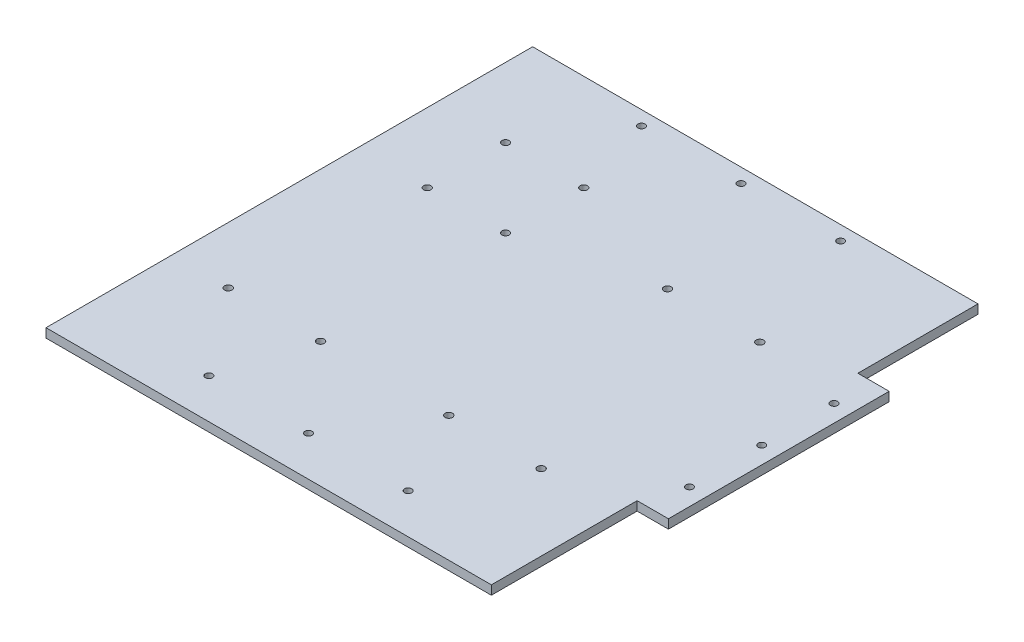
ISO-10303-21;
HEADER;
FILE_DESCRIPTION(('STEP AP214'),'2;1');
FILE_NAME('part.step','',(''),(''),'','','');
FILE_SCHEMA(('AUTOMOTIVE_DESIGN { 1 0 10303 214 1 1 1 1 }'));
ENDSEC;
DATA;
#1=APPLICATION_CONTEXT('core data for automotive mechanical design processes');
#2=APPLICATION_PROTOCOL_DEFINITION('international standard','automotive_design',2000,#1);
#3=PRODUCT_CONTEXT('',#1,'mechanical');
#4=PRODUCT('Part','Part','',(#3));
#5=PRODUCT_RELATED_PRODUCT_CATEGORY('part','',(#4));
#6=PRODUCT_DEFINITION_FORMATION('','',#4);
#7=PRODUCT_DEFINITION_CONTEXT('part definition',#1,'design');
#8=PRODUCT_DEFINITION('design','',#6,#7);
#9=PRODUCT_DEFINITION_SHAPE('','',#8);
#10=(LENGTH_UNIT() NAMED_UNIT(*) SI_UNIT(.MILLI.,.METRE.));
#11=(NAMED_UNIT(*) PLANE_ANGLE_UNIT() SI_UNIT($,.RADIAN.));
#12=(NAMED_UNIT(*) SI_UNIT($,.STERADIAN.) SOLID_ANGLE_UNIT());
#13=UNCERTAINTY_MEASURE_WITH_UNIT(LENGTH_MEASURE(1.E-05),#10,'distance_accuracy_value','');
#14=(GEOMETRIC_REPRESENTATION_CONTEXT(3) GLOBAL_UNCERTAINTY_ASSIGNED_CONTEXT((#13)) GLOBAL_UNIT_ASSIGNED_CONTEXT((#10,
#11,#12)) REPRESENTATION_CONTEXT('',''));
#15=CARTESIAN_POINT('',(0.,0.,0.));
#16=DIRECTION('',(0.,0.,1.));
#17=DIRECTION('',(1.,0.,0.));
#18=AXIS2_PLACEMENT_3D('',#15,#16,#17);
#19=CARTESIAN_POINT('',(156.499999999998,-6.35,171.));
#20=DIRECTION('',(1.,0.,0.));
#21=DIRECTION('',(0.,0.,-1.));
#22=AXIS2_PLACEMENT_3D('',#19,#20,#21);
#23=PLANE('',#22);
#24=DIRECTION('',(0.,0.,-1.));
#25=VECTOR('',#24,1.);
#26=CARTESIAN_POINT('',(156.499999999998,-6.35,171.));
#27=LINE('',#26,#25);
#28=CARTESIAN_POINT('',(156.499999999998,-6.35,171.));
#29=VERTEX_POINT('',#28);
#30=CARTESIAN_POINT('',(156.499999999998,-6.35,68.570201764885));
#31=VERTEX_POINT('',#30);
#32=EDGE_CURVE('E148',#29,#31,#27,.T.);
#33=ORIENTED_EDGE('',*,*,#32,.T.);
#34=DIRECTION('',(0.,1.,0.));
#35=VECTOR('',#34,1.);
#36=CARTESIAN_POINT('',(156.499999999998,-6.35,68.570201764885));
#37=LINE('',#36,#35);
#38=CARTESIAN_POINT('',(156.499999999998,0.,68.570201764885));
#39=VERTEX_POINT('',#38);
#40=EDGE_CURVE('E130',#31,#39,#37,.T.);
#41=ORIENTED_EDGE('',*,*,#40,.T.);
#42=DIRECTION('',(0.,0.,-1.));
#43=VECTOR('',#42,1.);
#44=CARTESIAN_POINT('',(156.499999999998,0.,171.));
#45=LINE('',#44,#43);
#46=CARTESIAN_POINT('',(156.499999999998,0.,171.));
#47=VERTEX_POINT('',#46);
#48=EDGE_CURVE('E158',#47,#39,#45,.T.);
#49=ORIENTED_EDGE('',*,*,#48,.F.);
#50=DIRECTION('',(0.,1.,0.));
#51=VECTOR('',#50,1.);
#52=CARTESIAN_POINT('',(156.499999999998,-6.35,171.));
#53=LINE('',#52,#51);
#54=EDGE_CURVE('E11',#29,#47,#53,.T.);
#55=ORIENTED_EDGE('',*,*,#54,.F.);
#56=EDGE_LOOP('',(#33,#41,#49,#55));
#57=FACE_BOUND('',#56,.T.);
#58=ADVANCED_FACE('F37',(#57),#23,.T.);
#59=DIRECTION('',(0.,1.,0.));
#60=VECTOR('',#59,1.);
#61=CARTESIAN_POINT('',(156.499999999998,-6.35,-86.570201764878));
#62=LINE('',#61,#60);
#63=CARTESIAN_POINT('',(156.499999999998,-6.35,-86.570201764878));
#64=VERTEX_POINT('',#63);
#65=CARTESIAN_POINT('',(156.499999999998,0.,-86.570201764878));
#66=VERTEX_POINT('',#65);
#67=EDGE_CURVE('E145',#64,#66,#62,.T.);
#68=ORIENTED_EDGE('',*,*,#67,.F.);
#69=CARTESIAN_POINT('',(156.499999999998,-6.35,-171.));
#70=VERTEX_POINT('',#69);
#71=EDGE_CURVE('E88',#64,#70,#27,.T.);
#72=ORIENTED_EDGE('',*,*,#71,.T.);
#73=DIRECTION('',(0.,1.,0.));
#74=VECTOR('',#73,1.);
#75=CARTESIAN_POINT('',(156.499999999998,-6.35,-171.));
#76=LINE('',#75,#74);
#77=CARTESIAN_POINT('',(156.499999999998,0.,-171.));
#78=VERTEX_POINT('',#77);
#79=EDGE_CURVE('E41',#70,#78,#76,.T.);
#80=ORIENTED_EDGE('',*,*,#79,.T.);
#81=EDGE_CURVE('E144',#66,#78,#45,.T.);
#82=ORIENTED_EDGE('',*,*,#81,.F.);
#83=EDGE_LOOP('',(#68,#72,#80,#82));
#84=FACE_BOUND('',#83,.T.);
#85=ADVANCED_FACE('F39',(#84),#23,.T.);
#86=CARTESIAN_POINT('',(-156.500000000002,-6.35,171.));
#87=DIRECTION('',(0.,0.,1.));
#88=DIRECTION('',(1.,0.,0.));
#89=AXIS2_PLACEMENT_3D('',#86,#87,#88);
#90=PLANE('',#89);
#91=DIRECTION('',(1.,0.,0.));
#92=VECTOR('',#91,1.);
#93=CARTESIAN_POINT('',(-156.500000000002,0.,171.));
#94=LINE('',#93,#92);
#95=CARTESIAN_POINT('',(-156.500000000002,0.,171.));
#96=VERTEX_POINT('',#95);
#97=EDGE_CURVE('E167',#96,#47,#94,.T.);
#98=ORIENTED_EDGE('',*,*,#97,.F.);
#99=DIRECTION('',(0.,1.,0.));
#100=VECTOR('',#99,1.);
#101=CARTESIAN_POINT('',(-156.500000000002,-6.35,171.));
#102=LINE('',#101,#100);
#103=CARTESIAN_POINT('',(-156.500000000002,-6.35,171.));
#104=VERTEX_POINT('',#103);
#105=EDGE_CURVE('E46',#104,#96,#102,.T.);
#106=ORIENTED_EDGE('',*,*,#105,.F.);
#107=DIRECTION('',(1.,0.,0.));
#108=VECTOR('',#107,1.);
#109=CARTESIAN_POINT('',(-156.500000000002,-6.35,171.));
#110=LINE('',#109,#108);
#111=EDGE_CURVE('E156',#104,#29,#110,.T.);
#112=ORIENTED_EDGE('',*,*,#111,.T.);
#113=ORIENTED_EDGE('',*,*,#54,.T.);
#114=EDGE_LOOP('',(#98,#106,#112,#113));
#115=FACE_BOUND('',#114,.T.);
#116=ADVANCED_FACE('F187',(#115),#90,.T.);
#117=CARTESIAN_POINT('',(-156.500000000002,-6.35,171.));
#118=DIRECTION('',(-1.,0.,0.));
#119=DIRECTION('',(0.,0.,1.));
#120=AXIS2_PLACEMENT_3D('',#117,#118,#119);
#121=PLANE('',#120);
#122=DIRECTION('',(0.,0.,1.));
#123=VECTOR('',#122,1.);
#124=CARTESIAN_POINT('',(-156.500000000002,0.,171.));
#125=LINE('',#124,#123);
#126=CARTESIAN_POINT('',(-156.500000000002,0.,-171.));
#127=VERTEX_POINT('',#126);
#128=EDGE_CURVE('E164',#127,#96,#125,.T.);
#129=ORIENTED_EDGE('',*,*,#128,.F.);
#130=DIRECTION('',(0.,1.,0.));
#131=VECTOR('',#130,1.);
#132=CARTESIAN_POINT('',(-156.500000000002,-6.35,-171.));
#133=LINE('',#132,#131);
#134=CARTESIAN_POINT('',(-156.500000000002,-6.35,-171.));
#135=VERTEX_POINT('',#134);
#136=EDGE_CURVE('E170',#135,#127,#133,.T.);
#137=ORIENTED_EDGE('',*,*,#136,.F.);
#138=DIRECTION('',(0.,0.,1.));
#139=VECTOR('',#138,1.);
#140=CARTESIAN_POINT('',(-156.500000000002,-6.35,171.));
#141=LINE('',#140,#139);
#142=EDGE_CURVE('E153',#135,#104,#141,.T.);
#143=ORIENTED_EDGE('',*,*,#142,.T.);
#144=ORIENTED_EDGE('',*,*,#105,.T.);
#145=EDGE_LOOP('',(#129,#137,#143,#144));
#146=FACE_BOUND('',#145,.T.);
#147=ADVANCED_FACE('F186',(#146),#121,.T.);
#148=CARTESIAN_POINT('',(-156.500000000002,-6.35,-171.));
#149=DIRECTION('',(0.,0.,-1.));
#150=DIRECTION('',(-1.,0.,0.));
#151=AXIS2_PLACEMENT_3D('',#148,#149,#150);
#152=PLANE('',#151);
#153=DIRECTION('',(-1.,0.,0.));
#154=VECTOR('',#153,1.);
#155=CARTESIAN_POINT('',(-156.500000000002,0.,-171.));
#156=LINE('',#155,#154);
#157=EDGE_CURVE('E161',#78,#127,#156,.T.);
#158=ORIENTED_EDGE('',*,*,#157,.F.);
#159=ORIENTED_EDGE('',*,*,#79,.F.);
#160=DIRECTION('',(-1.,0.,0.));
#161=VECTOR('',#160,1.);
#162=CARTESIAN_POINT('',(-156.500000000002,-6.35,-171.));
#163=LINE('',#162,#161);
#164=EDGE_CURVE('E150',#70,#135,#163,.T.);
#165=ORIENTED_EDGE('',*,*,#164,.T.);
#166=ORIENTED_EDGE('',*,*,#136,.T.);
#167=EDGE_LOOP('',(#158,#159,#165,#166));
#168=FACE_BOUND('',#167,.T.);
#169=ADVANCED_FACE('F176',(#168),#152,.T.);
#170=CARTESIAN_POINT('',(0.,-6.35,0.));
#171=DIRECTION('',(0.,-1.,0.));
#172=DIRECTION('',(0.,0.,-1.));
#173=AXIS2_PLACEMENT_3D('',#170,#171,#172);
#174=PLANE('',#173);
#175=CARTESIAN_POINT('',(38.2563465370358,-6.35,-71.0103183641671));
#176=DIRECTION('',(0.,1.,0.));
#177=DIRECTION('',(0.,0.,1.));
#178=AXIS2_PLACEMENT_3D('',#175,#176,#177);
#179=CIRCLE('',#178,2.60000000000004);
#180=CARTESIAN_POINT('',(38.2563465370358,-6.35,-68.4103183641671));
#181=VERTEX_POINT('',#180);
#182=EDGE_CURVE('E326',#181,#181,#179,.T.);
#183=ORIENTED_EDGE('',*,*,#182,.T.);
#184=EDGE_LOOP('',(#183));
#185=FACE_BOUND('',#184,.T.);
#186=CARTESIAN_POINT('',(-52.6874634884457,-6.35,-48.1309669484703));
#187=DIRECTION('',(0.,1.,0.));
#188=DIRECTION('',(0.,0.,1.));
#189=AXIS2_PLACEMENT_3D('',#186,#187,#188);
#190=CIRCLE('',#189,2.55000000000005);
#191=CARTESIAN_POINT('',(-52.6874634884457,-6.35,-45.5809669484703));
#192=VERTEX_POINT('',#191);
#193=EDGE_CURVE('E316',#192,#192,#190,.T.);
#194=ORIENTED_EDGE('',*,*,#193,.T.);
#195=EDGE_LOOP('',(#194));
#196=FACE_BOUND('',#195,.T.);
#197=CARTESIAN_POINT('',(-107.687463488446,-6.35,-48.1309669484707));
#198=DIRECTION('',(0.,1.,0.));
#199=DIRECTION('',(0.,0.,1.));
#200=AXIS2_PLACEMENT_3D('',#197,#198,#199);
#201=CIRCLE('',#200,2.55000000000005);
#202=CARTESIAN_POINT('',(-107.687463488446,-6.35,-45.5809669484707));
#203=VERTEX_POINT('',#202);
#204=EDGE_CURVE('E317',#203,#203,#201,.T.);
#205=ORIENTED_EDGE('',*,*,#204,.T.);
#206=EDGE_LOOP('',(#205));
#207=FACE_BOUND('',#206,.T.);
#208=CARTESIAN_POINT('',(-52.6874634884453,-6.35,-103.13096694847));
#209=DIRECTION('',(0.,1.,0.));
#210=DIRECTION('',(0.,0.,1.));
#211=AXIS2_PLACEMENT_3D('',#208,#209,#210);
#212=CIRCLE('',#211,2.55000000000005);
#213=CARTESIAN_POINT('',(-52.6874634884453,-6.35,-100.58096694847));
#214=VERTEX_POINT('',#213);
#215=EDGE_CURVE('E306',#214,#214,#212,.T.);
#216=ORIENTED_EDGE('',*,*,#215,.T.);
#217=EDGE_LOOP('',(#216));
#218=FACE_BOUND('',#217,.T.);
#219=CARTESIAN_POINT('',(38.3497100427501,-6.35,82.7832500906696));
#220=DIRECTION('',(0.,1.,0.));
#221=DIRECTION('',(0.,0.,1.));
#222=AXIS2_PLACEMENT_3D('',#219,#220,#221);
#223=CIRCLE('',#222,2.60000000000004);
#224=CARTESIAN_POINT('',(38.3497100427501,-6.35,85.3832500906697));
#225=VERTEX_POINT('',#224);
#226=EDGE_CURVE('E349',#225,#225,#223,.T.);
#227=ORIENTED_EDGE('',*,*,#226,.T.);
#228=EDGE_LOOP('',(#227));
#229=FACE_BOUND('',#228,.T.);
#230=CARTESIAN_POINT('',(-51.7502899572497,-6.35,82.783250090669));
#231=DIRECTION('',(0.,1.,0.));
#232=DIRECTION('',(0.,0.,1.));
#233=AXIS2_PLACEMENT_3D('',#230,#231,#232);
#234=CIRCLE('',#233,2.60000000000006);
#235=CARTESIAN_POINT('',(-51.7502899572497,-6.35,85.383250090669));
#236=VERTEX_POINT('',#235);
#237=EDGE_CURVE('E336',#236,#236,#234,.T.);
#238=ORIENTED_EDGE('',*,*,#237,.T.);
#239=EDGE_LOOP('',(#238));
#240=FACE_BOUND('',#239,.T.);
#241=CARTESIAN_POINT('',(-116.65028995725,-6.35,82.7832500906685));
#242=DIRECTION('',(0.,1.,0.));
#243=DIRECTION('',(0.,0.,1.));
#244=AXIS2_PLACEMENT_3D('',#241,#242,#243);
#245=CIRCLE('',#244,2.60000000000016);
#246=CARTESIAN_POINT('',(-116.65028995725,-6.35,85.3832500906687));
#247=VERTEX_POINT('',#246);
#248=EDGE_CURVE('E337',#247,#247,#245,.T.);
#249=ORIENTED_EDGE('',*,*,#248,.T.);
#250=EDGE_LOOP('',(#249));
#251=FACE_BOUND('',#250,.T.);
#252=CARTESIAN_POINT('',(103.156346537036,-6.35,-71.0103183641667));
#253=DIRECTION('',(0.,1.,0.));
#254=DIRECTION('',(0.,0.,1.));
#255=AXIS2_PLACEMENT_3D('',#252,#253,#254);
#256=CIRCLE('',#255,2.60000000000006);
#257=CARTESIAN_POINT('',(103.156346537036,-6.35,-68.4103183641666));
#258=VERTEX_POINT('',#257);
#259=EDGE_CURVE('E325',#258,#258,#256,.T.);
#260=ORIENTED_EDGE('',*,*,#259,.T.);
#261=EDGE_LOOP('',(#260));
#262=FACE_BOUND('',#261,.T.);
#263=CARTESIAN_POINT('',(-107.687463488445,-6.35,-103.130966948471));
#264=DIRECTION('',(0.,1.,0.));
#265=DIRECTION('',(0.,0.,1.));
#266=AXIS2_PLACEMENT_3D('',#263,#264,#265);
#267=CIRCLE('',#266,2.55000000000006);
#268=CARTESIAN_POINT('',(-107.687463488445,-6.35,-100.580966948471));
#269=VERTEX_POINT('',#268);
#270=EDGE_CURVE('E301',#269,#269,#267,.T.);
#271=ORIENTED_EDGE('',*,*,#270,.T.);
#272=EDGE_LOOP('',(#271));
#273=FACE_BOUND('',#272,.T.);
#274=CARTESIAN_POINT('',(103.24971004275,-6.35,82.7832500906701));
#275=DIRECTION('',(0.,1.,0.));
#276=DIRECTION('',(0.,0.,1.));
#277=AXIS2_PLACEMENT_3D('',#274,#275,#276);
#278=CIRCLE('',#277,2.60000000000004);
#279=CARTESIAN_POINT('',(103.24971004275,-6.35,85.3832500906701));
#280=VERTEX_POINT('',#279);
#281=EDGE_CURVE('E357',#280,#280,#278,.T.);
#282=ORIENTED_EDGE('',*,*,#281,.T.);
#283=EDGE_LOOP('',(#282));
#284=FACE_BOUND('',#283,.T.);
#285=CARTESIAN_POINT('',(-70.,-6.35,143.000000000004));
#286=DIRECTION('',(0.,1.,0.));
#287=DIRECTION('',(0.,0.,1.));
#288=AXIS2_PLACEMENT_3D('',#285,#286,#287);
#289=CIRCLE('',#288,2.5);
#290=CARTESIAN_POINT('',(-70.,-6.35,145.500000000004));
#291=VERTEX_POINT('',#290);
#292=EDGE_CURVE('E373',#291,#291,#289,.T.);
#293=ORIENTED_EDGE('',*,*,#292,.T.);
#294=EDGE_LOOP('',(#293));
#295=FACE_BOUND('',#294,.T.);
#296=CARTESIAN_POINT('',(70.,-6.35,143.000000000004));
#297=DIRECTION('',(0.,1.,0.));
#298=DIRECTION('',(0.,0.,-1.));
#299=AXIS2_PLACEMENT_3D('',#296,#297,#298);
#300=CIRCLE('',#299,2.5);
#301=CARTESIAN_POINT('',(70.,-6.35,140.500000000004));
#302=VERTEX_POINT('',#301);
#303=EDGE_CURVE('E379',#302,#302,#300,.T.);
#304=ORIENTED_EDGE('',*,*,#303,.T.);
#305=EDGE_LOOP('',(#304));
#306=FACE_BOUND('',#305,.T.);
#307=CARTESIAN_POINT('',(-70.,-6.35,-160.999999999996));
#308=DIRECTION('',(0.,1.,0.));
#309=DIRECTION('',(0.,0.,-1.));
#310=AXIS2_PLACEMENT_3D('',#307,#308,#309);
#311=CIRCLE('',#310,2.50000000000001);
#312=CARTESIAN_POINT('',(-70.,-6.35,-163.499999999996));
#313=VERTEX_POINT('',#312);
#314=EDGE_CURVE('E385',#313,#313,#311,.T.);
#315=ORIENTED_EDGE('',*,*,#314,.T.);
#316=EDGE_LOOP('',(#315));
#317=FACE_BOUND('',#316,.T.);
#318=CARTESIAN_POINT('',(0.,-6.35,-160.999999999996));
#319=DIRECTION('',(0.,1.,0.));
#320=DIRECTION('',(0.,0.,-1.));
#321=AXIS2_PLACEMENT_3D('',#318,#319,#320);
#322=CIRCLE('',#321,2.49999999999999);
#323=CARTESIAN_POINT('',(0.,-6.35,-163.499999999996));
#324=VERTEX_POINT('',#323);
#325=EDGE_CURVE('E366',#324,#324,#322,.T.);
#326=ORIENTED_EDGE('',*,*,#325,.T.);
#327=EDGE_LOOP('',(#326));
#328=FACE_BOUND('',#327,.T.);
#329=CARTESIAN_POINT('',(70.,-6.35,-160.999999999996));
#330=DIRECTION('',(0.,1.,0.));
#331=DIRECTION('',(0.,0.,1.));
#332=AXIS2_PLACEMENT_3D('',#329,#330,#331);
#333=CIRCLE('',#332,2.50000000000001);
#334=CARTESIAN_POINT('',(70.,-6.35,-158.499999999996));
#335=VERTEX_POINT('',#334);
#336=EDGE_CURVE('E360',#335,#335,#333,.T.);
#337=ORIENTED_EDGE('',*,*,#336,.T.);
#338=EDGE_LOOP('',(#337));
#339=FACE_BOUND('',#338,.T.);
#340=CARTESIAN_POINT('',(0.,-6.35,143.000000000004));
#341=DIRECTION('',(0.,1.,0.));
#342=DIRECTION('',(0.,0.,1.));
#343=AXIS2_PLACEMENT_3D('',#340,#341,#342);
#344=CIRCLE('',#343,2.5);
#345=CARTESIAN_POINT('',(0.,-6.35,145.500000000004));
#346=VERTEX_POINT('',#345);
#347=EDGE_CURVE('E393',#346,#346,#344,.T.);
#348=ORIENTED_EDGE('',*,*,#347,.T.);
#349=EDGE_LOOP('',(#348));
#350=FACE_BOUND('',#349,.T.);
#351=ORIENTED_EDGE('',*,*,#32,.F.);
#352=ORIENTED_EDGE('',*,*,#111,.F.);
#353=ORIENTED_EDGE('',*,*,#142,.F.);
#354=ORIENTED_EDGE('',*,*,#164,.F.);
#355=ORIENTED_EDGE('',*,*,#71,.F.);
#356=DIRECTION('',(-1.,0.,0.));
#357=VECTOR('',#356,1.);
#358=CARTESIAN_POINT('',(178.499999999998,-6.35,-86.570201764878));
#359=LINE('',#358,#357);
#360=CARTESIAN_POINT('',(178.499999999998,-6.35,-86.570201764878));
#361=VERTEX_POINT('',#360);
#362=EDGE_CURVE('E120',#361,#64,#359,.T.);
#363=ORIENTED_EDGE('',*,*,#362,.F.);
#364=DIRECTION('',(0.,0.,-1.));
#365=VECTOR('',#364,1.);
#366=CARTESIAN_POINT('',(178.499999999998,-6.35,68.570201764885));
#367=LINE('',#366,#365);
#368=CARTESIAN_POINT('',(178.499999999998,-6.35,68.570201764885));
#369=VERTEX_POINT('',#368);
#370=EDGE_CURVE('E115',#369,#361,#367,.T.);
#371=ORIENTED_EDGE('',*,*,#370,.F.);
#372=DIRECTION('',(1.,0.,0.));
#373=VECTOR('',#372,1.);
#374=CARTESIAN_POINT('',(156.499999999998,-6.35,68.570201764885));
#375=LINE('',#374,#373);
#376=EDGE_CURVE('E127',#31,#369,#375,.T.);
#377=ORIENTED_EDGE('',*,*,#376,.F.);
#378=EDGE_LOOP('',(#351,#352,#353,#354,#355,#363,#371,#377));
#379=FACE_BOUND('',#378,.T.);
#380=CARTESIAN_POINT('',(166.499999999998,-6.35,-59.7999999999965));
#381=DIRECTION('',(0.,1.,0.));
#382=DIRECTION('',(0.,0.,-1.));
#383=AXIS2_PLACEMENT_3D('',#380,#381,#382);
#384=CIRCLE('',#383,2.5);
#385=CARTESIAN_POINT('',(166.499999999998,-6.35,-62.2999999999965));
#386=VERTEX_POINT('',#385);
#387=EDGE_CURVE('E399',#386,#386,#384,.T.);
#388=ORIENTED_EDGE('',*,*,#387,.T.);
#389=EDGE_LOOP('',(#388));
#390=FACE_BOUND('',#389,.T.);
#391=CARTESIAN_POINT('',(166.499999999998,-6.35,41.8000000000035));
#392=DIRECTION('',(0.,1.,0.));
#393=DIRECTION('',(0.,0.,1.));
#394=AXIS2_PLACEMENT_3D('',#391,#392,#393);
#395=CIRCLE('',#394,2.5);
#396=CARTESIAN_POINT('',(166.499999999998,-6.35,44.3000000000035));
#397=VERTEX_POINT('',#396);
#398=EDGE_CURVE('E405',#397,#397,#395,.T.);
#399=ORIENTED_EDGE('',*,*,#398,.T.);
#400=EDGE_LOOP('',(#399));
#401=FACE_BOUND('',#400,.T.);
#402=CARTESIAN_POINT('',(166.499999999998,-6.35,-8.99999999999648));
#403=DIRECTION('',(0.,1.,0.));
#404=DIRECTION('',(0.,0.,1.));
#405=AXIS2_PLACEMENT_3D('',#402,#403,#404);
#406=CIRCLE('',#405,2.5);
#407=CARTESIAN_POINT('',(166.499999999998,-6.35,-6.49999999999649));
#408=VERTEX_POINT('',#407);
#409=EDGE_CURVE('E141',#408,#408,#406,.T.);
#410=ORIENTED_EDGE('',*,*,#409,.T.);
#411=EDGE_LOOP('',(#410));
#412=FACE_BOUND('',#411,.T.);
#413=ADVANCED_FACE('F125',(#185,#196,#207,#218,#229,#240,#251,#262,#273,#284,#295,#306,#317,
#328,#339,#350,#379,#390,#401,#412),#174,.T.);
#414=CARTESIAN_POINT('',(0.,0.,0.));
#415=DIRECTION('',(0.,-1.,0.));
#416=DIRECTION('',(0.,0.,-1.));
#417=AXIS2_PLACEMENT_3D('',#414,#415,#416);
#418=PLANE('',#417);
#419=CARTESIAN_POINT('',(38.2563465370358,0.,-71.0103183641671));
#420=DIRECTION('',(0.,1.,0.));
#421=DIRECTION('',(0.,0.,1.));
#422=AXIS2_PLACEMENT_3D('',#419,#420,#421);
#423=CIRCLE('',#422,2.60000000000004);
#424=CARTESIAN_POINT('',(38.2563465370358,0.,-68.4103183641671));
#425=VERTEX_POINT('',#424);
#426=EDGE_CURVE('E322',#425,#425,#423,.T.);
#427=ORIENTED_EDGE('',*,*,#426,.F.);
#428=EDGE_LOOP('',(#427));
#429=FACE_BOUND('',#428,.T.);
#430=CARTESIAN_POINT('',(-52.6874634884457,0.,-48.1309669484703));
#431=DIRECTION('',(0.,1.,0.));
#432=DIRECTION('',(0.,0.,1.));
#433=AXIS2_PLACEMENT_3D('',#430,#431,#432);
#434=CIRCLE('',#433,2.55000000000005);
#435=CARTESIAN_POINT('',(-52.6874634884457,0.,-45.5809669484703));
#436=VERTEX_POINT('',#435);
#437=EDGE_CURVE('E328',#436,#436,#434,.T.);
#438=ORIENTED_EDGE('',*,*,#437,.F.);
#439=EDGE_LOOP('',(#438));
#440=FACE_BOUND('',#439,.T.);
#441=CARTESIAN_POINT('',(-107.687463488446,0.,-48.1309669484707));
#442=DIRECTION('',(0.,1.,0.));
#443=DIRECTION('',(0.,0.,1.));
#444=AXIS2_PLACEMENT_3D('',#441,#442,#443);
#445=CIRCLE('',#444,2.55000000000005);
#446=CARTESIAN_POINT('',(-107.687463488446,0.,-45.5809669484707));
#447=VERTEX_POINT('',#446);
#448=EDGE_CURVE('E313',#447,#447,#445,.T.);
#449=ORIENTED_EDGE('',*,*,#448,.F.);
#450=EDGE_LOOP('',(#449));
#451=FACE_BOUND('',#450,.T.);
#452=CARTESIAN_POINT('',(-52.6874634884453,0.,-103.13096694847));
#453=DIRECTION('',(0.,1.,0.));
#454=DIRECTION('',(0.,0.,1.));
#455=AXIS2_PLACEMENT_3D('',#452,#453,#454);
#456=CIRCLE('',#455,2.55000000000005);
#457=CARTESIAN_POINT('',(-52.6874634884453,0.,-100.58096694847));
#458=VERTEX_POINT('',#457);
#459=EDGE_CURVE('E309',#458,#458,#456,.T.);
#460=ORIENTED_EDGE('',*,*,#459,.F.);
#461=EDGE_LOOP('',(#460));
#462=FACE_BOUND('',#461,.T.);
#463=CARTESIAN_POINT('',(38.3497100427501,0.,82.7832500906696));
#464=DIRECTION('',(0.,1.,0.));
#465=DIRECTION('',(0.,0.,1.));
#466=AXIS2_PLACEMENT_3D('',#463,#464,#465);
#467=CIRCLE('',#466,2.60000000000004);
#468=CARTESIAN_POINT('',(38.3497100427501,0.,85.3832500906697));
#469=VERTEX_POINT('',#468);
#470=EDGE_CURVE('E345',#469,#469,#467,.T.);
#471=ORIENTED_EDGE('',*,*,#470,.F.);
#472=EDGE_LOOP('',(#471));
#473=FACE_BOUND('',#472,.T.);
#474=CARTESIAN_POINT('',(-51.7502899572497,0.,82.783250090669));
#475=DIRECTION('',(0.,1.,0.));
#476=DIRECTION('',(0.,0.,1.));
#477=AXIS2_PLACEMENT_3D('',#474,#475,#476);
#478=CIRCLE('',#477,2.60000000000006);
#479=CARTESIAN_POINT('',(-51.7502899572497,0.,85.383250090669));
#480=VERTEX_POINT('',#479);
#481=EDGE_CURVE('E352',#480,#480,#478,.T.);
#482=ORIENTED_EDGE('',*,*,#481,.F.);
#483=EDGE_LOOP('',(#482));
#484=FACE_BOUND('',#483,.T.);
#485=CARTESIAN_POINT('',(-116.65028995725,0.,82.7832500906685));
#486=DIRECTION('',(0.,1.,0.));
#487=DIRECTION('',(0.,0.,1.));
#488=AXIS2_PLACEMENT_3D('',#485,#486,#487);
#489=CIRCLE('',#488,2.60000000000016);
#490=CARTESIAN_POINT('',(-116.65028995725,0.,85.3832500906687));
#491=VERTEX_POINT('',#490);
#492=EDGE_CURVE('E333',#491,#491,#489,.T.);
#493=ORIENTED_EDGE('',*,*,#492,.F.);
#494=EDGE_LOOP('',(#493));
#495=FACE_BOUND('',#494,.T.);
#496=CARTESIAN_POINT('',(103.156346537036,0.,-71.0103183641667));
#497=DIRECTION('',(0.,1.,0.));
#498=DIRECTION('',(0.,0.,1.));
#499=AXIS2_PLACEMENT_3D('',#496,#497,#498);
#500=CIRCLE('',#499,2.60000000000006);
#501=CARTESIAN_POINT('',(103.156346537036,0.,-68.4103183641666));
#502=VERTEX_POINT('',#501);
#503=EDGE_CURVE('E340',#502,#502,#500,.T.);
#504=ORIENTED_EDGE('',*,*,#503,.F.);
#505=EDGE_LOOP('',(#504));
#506=FACE_BOUND('',#505,.T.);
#507=CARTESIAN_POINT('',(-107.687463488445,0.,-103.130966948471));
#508=DIRECTION('',(0.,1.,0.));
#509=DIRECTION('',(0.,0.,1.));
#510=AXIS2_PLACEMENT_3D('',#507,#508,#509);
#511=CIRCLE('',#510,2.55000000000006);
#512=CARTESIAN_POINT('',(-107.687463488445,0.,-100.580966948471));
#513=VERTEX_POINT('',#512);
#514=EDGE_CURVE('E304',#513,#513,#511,.T.);
#515=ORIENTED_EDGE('',*,*,#514,.F.);
#516=EDGE_LOOP('',(#515));
#517=FACE_BOUND('',#516,.T.);
#518=CARTESIAN_POINT('',(103.24971004275,0.,82.7832500906701));
#519=DIRECTION('',(0.,1.,0.));
#520=DIRECTION('',(0.,0.,1.));
#521=AXIS2_PLACEMENT_3D('',#518,#519,#520);
#522=CIRCLE('',#521,2.60000000000004);
#523=CARTESIAN_POINT('',(103.24971004275,0.,85.3832500906701));
#524=VERTEX_POINT('',#523);
#525=EDGE_CURVE('E348',#524,#524,#522,.T.);
#526=ORIENTED_EDGE('',*,*,#525,.F.);
#527=EDGE_LOOP('',(#526));
#528=FACE_BOUND('',#527,.T.);
#529=CARTESIAN_POINT('',(-70.,0.,143.000000000004));
#530=DIRECTION('',(0.,1.,0.));
#531=DIRECTION('',(0.,0.,1.));
#532=AXIS2_PLACEMENT_3D('',#529,#530,#531);
#533=CIRCLE('',#532,2.5);
#534=CARTESIAN_POINT('',(-70.,0.,145.500000000004));
#535=VERTEX_POINT('',#534);
#536=EDGE_CURVE('E369',#535,#535,#533,.T.);
#537=ORIENTED_EDGE('',*,*,#536,.F.);
#538=EDGE_LOOP('',(#537));
#539=FACE_BOUND('',#538,.T.);
#540=CARTESIAN_POINT('',(70.,0.,143.000000000004));
#541=DIRECTION('',(0.,1.,0.));
#542=DIRECTION('',(0.,0.,-1.));
#543=AXIS2_PLACEMENT_3D('',#540,#541,#542);
#544=CIRCLE('',#543,2.5);
#545=CARTESIAN_POINT('',(70.,0.,140.500000000004));
#546=VERTEX_POINT('',#545);
#547=EDGE_CURVE('E376',#546,#546,#544,.T.);
#548=ORIENTED_EDGE('',*,*,#547,.F.);
#549=EDGE_LOOP('',(#548));
#550=FACE_BOUND('',#549,.T.);
#551=CARTESIAN_POINT('',(-70.,0.,-160.999999999996));
#552=DIRECTION('',(0.,1.,0.));
#553=DIRECTION('',(0.,0.,-1.));
#554=AXIS2_PLACEMENT_3D('',#551,#552,#553);
#555=CIRCLE('',#554,2.50000000000001);
#556=CARTESIAN_POINT('',(-70.,0.,-163.499999999996));
#557=VERTEX_POINT('',#556);
#558=EDGE_CURVE('E382',#557,#557,#555,.T.);
#559=ORIENTED_EDGE('',*,*,#558,.F.);
#560=EDGE_LOOP('',(#559));
#561=FACE_BOUND('',#560,.T.);
#562=CARTESIAN_POINT('',(0.,0.,-160.999999999996));
#563=DIRECTION('',(0.,1.,0.));
#564=DIRECTION('',(0.,0.,-1.));
#565=AXIS2_PLACEMENT_3D('',#562,#563,#564);
#566=CIRCLE('',#565,2.49999999999999);
#567=CARTESIAN_POINT('',(0.,0.,-163.499999999996));
#568=VERTEX_POINT('',#567);
#569=EDGE_CURVE('E388',#568,#568,#566,.T.);
#570=ORIENTED_EDGE('',*,*,#569,.F.);
#571=EDGE_LOOP('',(#570));
#572=FACE_BOUND('',#571,.T.);
#573=CARTESIAN_POINT('',(70.,0.,-160.999999999996));
#574=DIRECTION('',(0.,1.,0.));
#575=DIRECTION('',(0.,0.,1.));
#576=AXIS2_PLACEMENT_3D('',#573,#574,#575);
#577=CIRCLE('',#576,2.50000000000001);
#578=CARTESIAN_POINT('',(70.,0.,-158.499999999996));
#579=VERTEX_POINT('',#578);
#580=EDGE_CURVE('E363',#579,#579,#577,.T.);
#581=ORIENTED_EDGE('',*,*,#580,.F.);
#582=EDGE_LOOP('',(#581));
#583=FACE_BOUND('',#582,.T.);
#584=CARTESIAN_POINT('',(0.,0.,143.000000000004));
#585=DIRECTION('',(0.,1.,0.));
#586=DIRECTION('',(0.,0.,1.));
#587=AXIS2_PLACEMENT_3D('',#584,#585,#586);
#588=CIRCLE('',#587,2.5);
#589=CARTESIAN_POINT('',(0.,0.,145.500000000004));
#590=VERTEX_POINT('',#589);
#591=EDGE_CURVE('E372',#590,#590,#588,.T.);
#592=ORIENTED_EDGE('',*,*,#591,.F.);
#593=EDGE_LOOP('',(#592));
#594=FACE_BOUND('',#593,.T.);
#595=ORIENTED_EDGE('',*,*,#48,.T.);
#596=DIRECTION('',(1.,0.,0.));
#597=VECTOR('',#596,1.);
#598=CARTESIAN_POINT('',(156.499999999998,0.,68.570201764885));
#599=LINE('',#598,#597);
#600=CARTESIAN_POINT('',(178.499999999998,0.,68.570201764885));
#601=VERTEX_POINT('',#600);
#602=EDGE_CURVE('E54',#39,#601,#599,.T.);
#603=ORIENTED_EDGE('',*,*,#602,.T.);
#604=DIRECTION('',(0.,0.,-1.));
#605=VECTOR('',#604,1.);
#606=CARTESIAN_POINT('',(178.499999999998,0.,68.570201764885));
#607=LINE('',#606,#605);
#608=CARTESIAN_POINT('',(178.499999999998,0.,-86.570201764878));
#609=VERTEX_POINT('',#608);
#610=EDGE_CURVE('E117',#601,#609,#607,.T.);
#611=ORIENTED_EDGE('',*,*,#610,.T.);
#612=DIRECTION('',(-1.,0.,0.));
#613=VECTOR('',#612,1.);
#614=CARTESIAN_POINT('',(178.499999999998,0.,-86.570201764878));
#615=LINE('',#614,#613);
#616=EDGE_CURVE('E131',#609,#66,#615,.T.);
#617=ORIENTED_EDGE('',*,*,#616,.T.);
#618=ORIENTED_EDGE('',*,*,#81,.T.);
#619=ORIENTED_EDGE('',*,*,#157,.T.);
#620=ORIENTED_EDGE('',*,*,#128,.T.);
#621=ORIENTED_EDGE('',*,*,#97,.T.);
#622=EDGE_LOOP('',(#595,#603,#611,#617,#618,#619,#620,#621));
#623=FACE_BOUND('',#622,.T.);
#624=CARTESIAN_POINT('',(166.499999999998,0.,-59.7999999999965));
#625=DIRECTION('',(0.,1.,0.));
#626=DIRECTION('',(0.,0.,-1.));
#627=AXIS2_PLACEMENT_3D('',#624,#625,#626);
#628=CIRCLE('',#627,2.5);
#629=CARTESIAN_POINT('',(166.499999999998,0.,-62.2999999999965));
#630=VERTEX_POINT('',#629);
#631=EDGE_CURVE('E396',#630,#630,#628,.T.);
#632=ORIENTED_EDGE('',*,*,#631,.F.);
#633=EDGE_LOOP('',(#632));
#634=FACE_BOUND('',#633,.T.);
#635=CARTESIAN_POINT('',(166.499999999998,0.,41.8000000000035));
#636=DIRECTION('',(0.,1.,0.));
#637=DIRECTION('',(0.,0.,1.));
#638=AXIS2_PLACEMENT_3D('',#635,#636,#637);
#639=CIRCLE('',#638,2.5);
#640=CARTESIAN_POINT('',(166.499999999998,0.,44.3000000000035));
#641=VERTEX_POINT('',#640);
#642=EDGE_CURVE('E402',#641,#641,#639,.T.);
#643=ORIENTED_EDGE('',*,*,#642,.F.);
#644=EDGE_LOOP('',(#643));
#645=FACE_BOUND('',#644,.T.);
#646=CARTESIAN_POINT('',(166.499999999998,0.,-8.99999999999648));
#647=DIRECTION('',(0.,1.,0.));
#648=DIRECTION('',(0.,0.,1.));
#649=AXIS2_PLACEMENT_3D('',#646,#647,#648);
#650=CIRCLE('',#649,2.5);
#651=CARTESIAN_POINT('',(166.499999999998,0.,-6.49999999999649));
#652=VERTEX_POINT('',#651);
#653=EDGE_CURVE('E136',#652,#652,#650,.T.);
#654=ORIENTED_EDGE('',*,*,#653,.F.);
#655=EDGE_LOOP('',(#654));
#656=FACE_BOUND('',#655,.T.);
#657=ADVANCED_FACE('F178',(#429,#440,#451,#462,#473,#484,#495,#506,#517,#528,#539,#550,#561,
#572,#583,#594,#623,#634,#645,#656),#418,.F.);
#658=CARTESIAN_POINT('',(156.499999999998,-6.35,68.570201764885));
#659=DIRECTION('',(0.,0.,1.));
#660=DIRECTION('',(1.,0.,0.));
#661=AXIS2_PLACEMENT_3D('',#658,#659,#660);
#662=PLANE('',#661);
#663=ORIENTED_EDGE('',*,*,#602,.F.);
#664=ORIENTED_EDGE('',*,*,#40,.F.);
#665=ORIENTED_EDGE('',*,*,#376,.T.);
#666=DIRECTION('',(0.,1.,0.));
#667=VECTOR('',#666,1.);
#668=CARTESIAN_POINT('',(178.499999999998,-6.35,68.570201764885));
#669=LINE('',#668,#667);
#670=EDGE_CURVE('E112',#369,#601,#669,.T.);
#671=ORIENTED_EDGE('',*,*,#670,.T.);
#672=EDGE_LOOP('',(#663,#664,#665,#671));
#673=FACE_BOUND('',#672,.T.);
#674=ADVANCED_FACE('F129',(#673),#662,.T.);
#675=CARTESIAN_POINT('',(178.499999999998,-6.35,-86.570201764878));
#676=DIRECTION('',(0.,0.,-1.));
#677=DIRECTION('',(-1.,0.,0.));
#678=AXIS2_PLACEMENT_3D('',#675,#676,#677);
#679=PLANE('',#678);
#680=ORIENTED_EDGE('',*,*,#616,.F.);
#681=DIRECTION('',(0.,1.,0.));
#682=VECTOR('',#681,1.);
#683=CARTESIAN_POINT('',(178.499999999998,-6.35,-86.570201764878));
#684=LINE('',#683,#682);
#685=EDGE_CURVE('E119',#361,#609,#684,.T.);
#686=ORIENTED_EDGE('',*,*,#685,.F.);
#687=ORIENTED_EDGE('',*,*,#362,.T.);
#688=ORIENTED_EDGE('',*,*,#67,.T.);
#689=EDGE_LOOP('',(#680,#686,#687,#688));
#690=FACE_BOUND('',#689,.T.);
#691=ADVANCED_FACE('F182',(#690),#679,.T.);
#692=CARTESIAN_POINT('',(178.499999999998,-6.35,68.570201764885));
#693=DIRECTION('',(1.,0.,0.));
#694=DIRECTION('',(0.,0.,-1.));
#695=AXIS2_PLACEMENT_3D('',#692,#693,#694);
#696=PLANE('',#695);
#697=ORIENTED_EDGE('',*,*,#610,.F.);
#698=ORIENTED_EDGE('',*,*,#670,.F.);
#699=ORIENTED_EDGE('',*,*,#370,.T.);
#700=ORIENTED_EDGE('',*,*,#685,.T.);
#701=EDGE_LOOP('',(#697,#698,#699,#700));
#702=FACE_BOUND('',#701,.T.);
#703=ADVANCED_FACE('F114',(#702),#696,.T.);
#704=CARTESIAN_POINT('',(166.499999999998,-6.35,-8.99999999999648));
#705=DIRECTION('',(0.,1.,0.));
#706=DIRECTION('',(0.,0.,1.));
#707=AXIS2_PLACEMENT_3D('',#704,#705,#706);
#708=CYLINDRICAL_SURFACE('',#707,2.5);
#709=ORIENTED_EDGE('',*,*,#409,.F.);
#710=EDGE_LOOP('',(#709));
#711=FACE_BOUND('',#710,.T.);
#712=ORIENTED_EDGE('',*,*,#653,.T.);
#713=EDGE_LOOP('',(#712));
#714=FACE_BOUND('',#713,.T.);
#715=ADVANCED_FACE('F219',(#711,#714),#708,.F.);
#716=CARTESIAN_POINT('',(166.499999999998,-6.35,41.8000000000035));
#717=DIRECTION('',(0.,1.,0.));
#718=DIRECTION('',(0.,0.,1.));
#719=AXIS2_PLACEMENT_3D('',#716,#717,#718);
#720=CYLINDRICAL_SURFACE('',#719,2.5);
#721=ORIENTED_EDGE('',*,*,#398,.F.);
#722=EDGE_LOOP('',(#721));
#723=FACE_BOUND('',#722,.T.);
#724=ORIENTED_EDGE('',*,*,#642,.T.);
#725=EDGE_LOOP('',(#724));
#726=FACE_BOUND('',#725,.T.);
#727=ADVANCED_FACE('F224',(#723,#726),#720,.F.);
#728=CARTESIAN_POINT('',(166.499999999998,-6.35,-59.7999999999965));
#729=DIRECTION('',(0.,1.,0.));
#730=DIRECTION('',(0.,0.,1.));
#731=AXIS2_PLACEMENT_3D('',#728,#729,#730);
#732=CYLINDRICAL_SURFACE('',#731,2.5);
#733=ORIENTED_EDGE('',*,*,#387,.F.);
#734=EDGE_LOOP('',(#733));
#735=FACE_BOUND('',#734,.T.);
#736=ORIENTED_EDGE('',*,*,#631,.T.);
#737=EDGE_LOOP('',(#736));
#738=FACE_BOUND('',#737,.T.);
#739=ADVANCED_FACE('F228',(#735,#738),#732,.F.);
#740=CARTESIAN_POINT('',(0.,-6.35,143.000000000004));
#741=DIRECTION('',(0.,1.,0.));
#742=DIRECTION('',(0.,0.,1.));
#743=AXIS2_PLACEMENT_3D('',#740,#741,#742);
#744=CYLINDRICAL_SURFACE('',#743,2.5);
#745=ORIENTED_EDGE('',*,*,#347,.F.);
#746=EDGE_LOOP('',(#745));
#747=FACE_BOUND('',#746,.T.);
#748=ORIENTED_EDGE('',*,*,#591,.T.);
#749=EDGE_LOOP('',(#748));
#750=FACE_BOUND('',#749,.T.);
#751=ADVANCED_FACE('F232',(#747,#750),#744,.F.);
#752=CARTESIAN_POINT('',(70.,-6.35,-160.999999999996));
#753=DIRECTION('',(0.,1.,0.));
#754=DIRECTION('',(0.,0.,1.));
#755=AXIS2_PLACEMENT_3D('',#752,#753,#754);
#756=CYLINDRICAL_SURFACE('',#755,2.50000000000001);
#757=ORIENTED_EDGE('',*,*,#336,.F.);
#758=EDGE_LOOP('',(#757));
#759=FACE_BOUND('',#758,.T.);
#760=ORIENTED_EDGE('',*,*,#580,.T.);
#761=EDGE_LOOP('',(#760));
#762=FACE_BOUND('',#761,.T.);
#763=ADVANCED_FACE('F236',(#759,#762),#756,.F.);
#764=CARTESIAN_POINT('',(0.,-6.35,-160.999999999996));
#765=DIRECTION('',(0.,1.,0.));
#766=DIRECTION('',(0.,0.,1.));
#767=AXIS2_PLACEMENT_3D('',#764,#765,#766);
#768=CYLINDRICAL_SURFACE('',#767,2.49999999999999);
#769=ORIENTED_EDGE('',*,*,#325,.F.);
#770=EDGE_LOOP('',(#769));
#771=FACE_BOUND('',#770,.T.);
#772=ORIENTED_EDGE('',*,*,#569,.T.);
#773=EDGE_LOOP('',(#772));
#774=FACE_BOUND('',#773,.T.);
#775=ADVANCED_FACE('F238',(#771,#774),#768,.F.);
#776=CARTESIAN_POINT('',(-70.,-6.35,-160.999999999996));
#777=DIRECTION('',(0.,1.,0.));
#778=DIRECTION('',(0.,0.,1.));
#779=AXIS2_PLACEMENT_3D('',#776,#777,#778);
#780=CYLINDRICAL_SURFACE('',#779,2.50000000000001);
#781=ORIENTED_EDGE('',*,*,#314,.F.);
#782=EDGE_LOOP('',(#781));
#783=FACE_BOUND('',#782,.T.);
#784=ORIENTED_EDGE('',*,*,#558,.T.);
#785=EDGE_LOOP('',(#784));
#786=FACE_BOUND('',#785,.T.);
#787=ADVANCED_FACE('F241',(#783,#786),#780,.F.);
#788=CARTESIAN_POINT('',(70.,-6.35,143.000000000004));
#789=DIRECTION('',(0.,1.,0.));
#790=DIRECTION('',(0.,0.,1.));
#791=AXIS2_PLACEMENT_3D('',#788,#789,#790);
#792=CYLINDRICAL_SURFACE('',#791,2.5);
#793=ORIENTED_EDGE('',*,*,#303,.F.);
#794=EDGE_LOOP('',(#793));
#795=FACE_BOUND('',#794,.T.);
#796=ORIENTED_EDGE('',*,*,#547,.T.);
#797=EDGE_LOOP('',(#796));
#798=FACE_BOUND('',#797,.T.);
#799=ADVANCED_FACE('F245',(#795,#798),#792,.F.);
#800=CARTESIAN_POINT('',(-70.,-6.35,143.000000000004));
#801=DIRECTION('',(0.,1.,0.));
#802=DIRECTION('',(0.,0.,1.));
#803=AXIS2_PLACEMENT_3D('',#800,#801,#802);
#804=CYLINDRICAL_SURFACE('',#803,2.5);
#805=ORIENTED_EDGE('',*,*,#292,.F.);
#806=EDGE_LOOP('',(#805));
#807=FACE_BOUND('',#806,.T.);
#808=ORIENTED_EDGE('',*,*,#536,.T.);
#809=EDGE_LOOP('',(#808));
#810=FACE_BOUND('',#809,.T.);
#811=ADVANCED_FACE('F249',(#807,#810),#804,.F.);
#812=CARTESIAN_POINT('',(103.24971004275,-6.35,82.7832500906701));
#813=DIRECTION('',(0.,1.,0.));
#814=DIRECTION('',(0.,0.,1.));
#815=AXIS2_PLACEMENT_3D('',#812,#813,#814);
#816=CYLINDRICAL_SURFACE('',#815,2.60000000000004);
#817=ORIENTED_EDGE('',*,*,#281,.F.);
#818=EDGE_LOOP('',(#817));
#819=FACE_BOUND('',#818,.T.);
#820=ORIENTED_EDGE('',*,*,#525,.T.);
#821=EDGE_LOOP('',(#820));
#822=FACE_BOUND('',#821,.T.);
#823=ADVANCED_FACE('F253',(#819,#822),#816,.F.);
#824=CARTESIAN_POINT('',(-107.687463488445,-6.35,-103.130966948471));
#825=DIRECTION('',(0.,1.,0.));
#826=DIRECTION('',(0.,0.,1.));
#827=AXIS2_PLACEMENT_3D('',#824,#825,#826);
#828=CYLINDRICAL_SURFACE('',#827,2.55000000000006);
#829=ORIENTED_EDGE('',*,*,#270,.F.);
#830=EDGE_LOOP('',(#829));
#831=FACE_BOUND('',#830,.T.);
#832=ORIENTED_EDGE('',*,*,#514,.T.);
#833=EDGE_LOOP('',(#832));
#834=FACE_BOUND('',#833,.T.);
#835=ADVANCED_FACE('F260',(#831,#834),#828,.F.);
#836=CARTESIAN_POINT('',(103.156346537036,-6.35,-71.0103183641667));
#837=DIRECTION('',(0.,1.,0.));
#838=DIRECTION('',(0.,0.,1.));
#839=AXIS2_PLACEMENT_3D('',#836,#837,#838);
#840=CYLINDRICAL_SURFACE('',#839,2.60000000000006);
#841=ORIENTED_EDGE('',*,*,#259,.F.);
#842=EDGE_LOOP('',(#841));
#843=FACE_BOUND('',#842,.T.);
#844=ORIENTED_EDGE('',*,*,#503,.T.);
#845=EDGE_LOOP('',(#844));
#846=FACE_BOUND('',#845,.T.);
#847=ADVANCED_FACE('F272',(#843,#846),#840,.F.);
#848=CARTESIAN_POINT('',(-116.65028995725,-6.35,82.7832500906685));
#849=DIRECTION('',(0.,1.,0.));
#850=DIRECTION('',(0.,0.,1.));
#851=AXIS2_PLACEMENT_3D('',#848,#849,#850);
#852=CYLINDRICAL_SURFACE('',#851,2.60000000000016);
#853=ORIENTED_EDGE('',*,*,#248,.F.);
#854=EDGE_LOOP('',(#853));
#855=FACE_BOUND('',#854,.T.);
#856=ORIENTED_EDGE('',*,*,#492,.T.);
#857=EDGE_LOOP('',(#856));
#858=FACE_BOUND('',#857,.T.);
#859=ADVANCED_FACE('F266',(#855,#858),#852,.F.);
#860=CARTESIAN_POINT('',(-51.7502899572497,-6.35,82.783250090669));
#861=DIRECTION('',(0.,1.,0.));
#862=DIRECTION('',(0.,0.,1.));
#863=AXIS2_PLACEMENT_3D('',#860,#861,#862);
#864=CYLINDRICAL_SURFACE('',#863,2.60000000000006);
#865=ORIENTED_EDGE('',*,*,#237,.F.);
#866=EDGE_LOOP('',(#865));
#867=FACE_BOUND('',#866,.T.);
#868=ORIENTED_EDGE('',*,*,#481,.T.);
#869=EDGE_LOOP('',(#868));
#870=FACE_BOUND('',#869,.T.);
#871=ADVANCED_FACE('F262',(#867,#870),#864,.F.);
#872=CARTESIAN_POINT('',(38.3497100427501,-6.35,82.7832500906696));
#873=DIRECTION('',(0.,1.,0.));
#874=DIRECTION('',(0.,0.,1.));
#875=AXIS2_PLACEMENT_3D('',#872,#873,#874);
#876=CYLINDRICAL_SURFACE('',#875,2.60000000000004);
#877=ORIENTED_EDGE('',*,*,#226,.F.);
#878=EDGE_LOOP('',(#877));
#879=FACE_BOUND('',#878,.T.);
#880=ORIENTED_EDGE('',*,*,#470,.T.);
#881=EDGE_LOOP('',(#880));
#882=FACE_BOUND('',#881,.T.);
#883=ADVANCED_FACE('F265',(#879,#882),#876,.F.);
#884=CARTESIAN_POINT('',(-52.6874634884453,-6.35,-103.13096694847));
#885=DIRECTION('',(0.,1.,0.));
#886=DIRECTION('',(0.,0.,1.));
#887=AXIS2_PLACEMENT_3D('',#884,#885,#886);
#888=CYLINDRICAL_SURFACE('',#887,2.55000000000005);
#889=ORIENTED_EDGE('',*,*,#215,.F.);
#890=EDGE_LOOP('',(#889));
#891=FACE_BOUND('',#890,.T.);
#892=ORIENTED_EDGE('',*,*,#459,.T.);
#893=EDGE_LOOP('',(#892));
#894=FACE_BOUND('',#893,.T.);
#895=ADVANCED_FACE('F270',(#891,#894),#888,.F.);
#896=CARTESIAN_POINT('',(-107.687463488446,-6.35,-48.1309669484707));
#897=DIRECTION('',(0.,1.,0.));
#898=DIRECTION('',(0.,0.,1.));
#899=AXIS2_PLACEMENT_3D('',#896,#897,#898);
#900=CYLINDRICAL_SURFACE('',#899,2.55000000000005);
#901=ORIENTED_EDGE('',*,*,#204,.F.);
#902=EDGE_LOOP('',(#901));
#903=FACE_BOUND('',#902,.T.);
#904=ORIENTED_EDGE('',*,*,#448,.T.);
#905=EDGE_LOOP('',(#904));
#906=FACE_BOUND('',#905,.T.);
#907=ADVANCED_FACE('F283',(#903,#906),#900,.F.);
#908=CARTESIAN_POINT('',(-52.6874634884457,-6.35,-48.1309669484703));
#909=DIRECTION('',(0.,1.,0.));
#910=DIRECTION('',(0.,0.,1.));
#911=AXIS2_PLACEMENT_3D('',#908,#909,#910);
#912=CYLINDRICAL_SURFACE('',#911,2.55000000000005);
#913=ORIENTED_EDGE('',*,*,#193,.F.);
#914=EDGE_LOOP('',(#913));
#915=FACE_BOUND('',#914,.T.);
#916=ORIENTED_EDGE('',*,*,#437,.T.);
#917=EDGE_LOOP('',(#916));
#918=FACE_BOUND('',#917,.T.);
#919=ADVANCED_FACE('F279',(#915,#918),#912,.F.);
#920=CARTESIAN_POINT('',(38.2563465370358,-6.35,-71.0103183641671));
#921=DIRECTION('',(0.,1.,0.));
#922=DIRECTION('',(0.,0.,1.));
#923=AXIS2_PLACEMENT_3D('',#920,#921,#922);
#924=CYLINDRICAL_SURFACE('',#923,2.60000000000004);
#925=ORIENTED_EDGE('',*,*,#182,.F.);
#926=EDGE_LOOP('',(#925));
#927=FACE_BOUND('',#926,.T.);
#928=ORIENTED_EDGE('',*,*,#426,.T.);
#929=EDGE_LOOP('',(#928));
#930=FACE_BOUND('',#929,.T.);
#931=ADVANCED_FACE('F282',(#927,#930),#924,.F.);
#932=CLOSED_SHELL('',(#58,#85,#116,#147,#169,#413,#657,#674,#691,#703,#715,#727,#739,#751,#763,
#775,#787,#799,#811,#823,#835,#847,#859,#871,#883,#895,#907,#919,#931));
#933=MANIFOLD_SOLID_BREP('B2',#932);
#934=ADVANCED_BREP_SHAPE_REPRESENTATION('',(#18,#933),#14);
#935=SHAPE_DEFINITION_REPRESENTATION(#9,#934);
ENDSEC;
END-ISO-10303-21;
